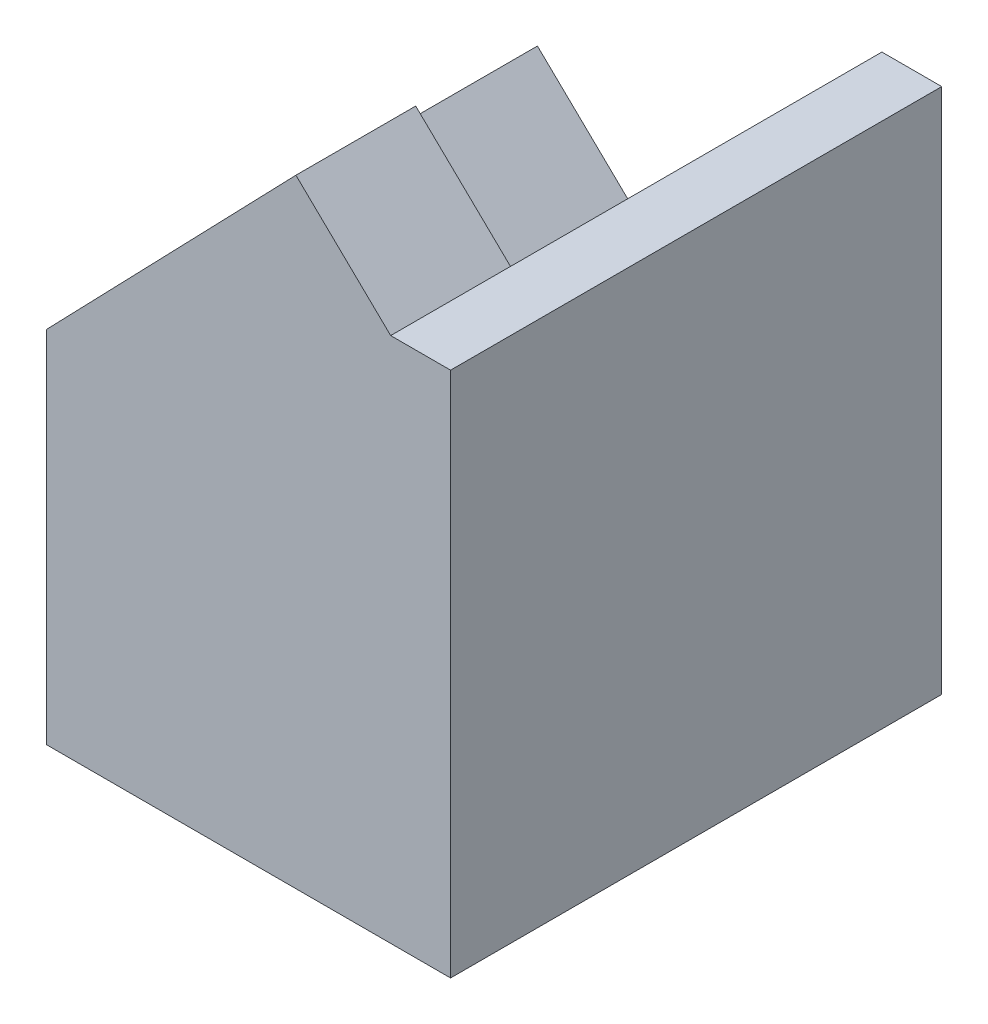
ISO-10303-21;
HEADER;
FILE_DESCRIPTION(('STEP AP214'),'2;1');
FILE_NAME('part.step','',(''),(''),'','','');
FILE_SCHEMA(('AUTOMOTIVE_DESIGN { 1 0 10303 214 1 1 1 1 }'));
ENDSEC;
DATA;
#1=APPLICATION_CONTEXT('core data for automotive mechanical design processes');
#2=APPLICATION_PROTOCOL_DEFINITION('international standard','automotive_design',2000,#1);
#3=PRODUCT_CONTEXT('',#1,'mechanical');
#4=PRODUCT('Part','Part','',(#3));
#5=PRODUCT_RELATED_PRODUCT_CATEGORY('part','',(#4));
#6=PRODUCT_DEFINITION_FORMATION('','',#4);
#7=PRODUCT_DEFINITION_CONTEXT('part definition',#1,'design');
#8=PRODUCT_DEFINITION('design','',#6,#7);
#9=PRODUCT_DEFINITION_SHAPE('','',#8);
#10=(LENGTH_UNIT() NAMED_UNIT(*) SI_UNIT(.MILLI.,.METRE.));
#11=(NAMED_UNIT(*) PLANE_ANGLE_UNIT() SI_UNIT($,.RADIAN.));
#12=(NAMED_UNIT(*) SI_UNIT($,.STERADIAN.) SOLID_ANGLE_UNIT());
#13=UNCERTAINTY_MEASURE_WITH_UNIT(LENGTH_MEASURE(1.E-05),#10,'distance_accuracy_value','');
#14=(GEOMETRIC_REPRESENTATION_CONTEXT(3) GLOBAL_UNCERTAINTY_ASSIGNED_CONTEXT((#13)) GLOBAL_UNIT_ASSIGNED_CONTEXT((#10,
#11,#12)) REPRESENTATION_CONTEXT('',''));
#15=CARTESIAN_POINT('',(0.,0.,0.));
#16=DIRECTION('',(0.,0.,1.));
#17=DIRECTION('',(1.,0.,0.));
#18=AXIS2_PLACEMENT_3D('',#15,#16,#17);
#19=CARTESIAN_POINT('',(0.,2.,8.2));
#20=DIRECTION('',(1.,0.,0.));
#21=DIRECTION('',(0.,1.,0.));
#22=AXIS2_PLACEMENT_3D('',#19,#20,#21);
#23=PLANE('',#22);
#24=DIRECTION('',(0.,-1.,0.));
#25=VECTOR('',#24,1.);
#26=CARTESIAN_POINT('',(0.,2.,0.));
#27=LINE('',#26,#25);
#28=CARTESIAN_POINT('',(0.,2.,0.));
#29=VERTEX_POINT('',#28);
#30=CARTESIAN_POINT('',(0.,-4.,0.));
#31=VERTEX_POINT('',#30);
#32=EDGE_CURVE('E114',#29,#31,#27,.T.);
#33=ORIENTED_EDGE('',*,*,#32,.T.);
#34=DIRECTION('',(0.,0.,-1.));
#35=VECTOR('',#34,1.);
#36=CARTESIAN_POINT('',(0.,-4.,8.2));
#37=LINE('',#36,#35);
#38=CARTESIAN_POINT('',(0.,-4.,8.2));
#39=VERTEX_POINT('',#38);
#40=EDGE_CURVE('E197',#39,#31,#37,.T.);
#41=ORIENTED_EDGE('',*,*,#40,.F.);
#42=DIRECTION('',(0.,-1.,0.));
#43=VECTOR('',#42,1.);
#44=CARTESIAN_POINT('',(0.,2.,8.2));
#45=LINE('',#44,#43);
#46=CARTESIAN_POINT('',(0.,2.,8.2));
#47=VERTEX_POINT('',#46);
#48=EDGE_CURVE('E121',#47,#39,#45,.T.);
#49=ORIENTED_EDGE('',*,*,#48,.F.);
#50=DIRECTION('',(0.,0.,-1.));
#51=VECTOR('',#50,1.);
#52=CARTESIAN_POINT('',(0.,2.,8.2));
#53=LINE('',#52,#51);
#54=CARTESIAN_POINT('',(0.,2.,6.45));
#55=VERTEX_POINT('',#54);
#56=EDGE_CURVE('E110',#47,#55,#53,.T.);
#57=ORIENTED_EDGE('',*,*,#56,.T.);
#58=DIRECTION('',(0.,0.,1.));
#59=VECTOR('',#58,1.);
#60=CARTESIAN_POINT('',(0.,2.,6.45));
#61=LINE('',#60,#59);
#62=EDGE_CURVE('E167',#29,#55,#61,.T.);
#63=ORIENTED_EDGE('',*,*,#62,.F.);
#64=EDGE_LOOP('',(#33,#41,#49,#57,#63));
#65=FACE_BOUND('',#64,.T.);
#66=ADVANCED_FACE('F36',(#65),#23,.F.);
#67=CARTESIAN_POINT('',(6.75,0.,8.2));
#68=DIRECTION('',(-1.,0.,0.));
#69=DIRECTION('',(0.,0.,1.));
#70=AXIS2_PLACEMENT_3D('',#67,#68,#69);
#71=PLANE('',#70);
#72=DIRECTION('',(0.,1.,0.));
#73=VECTOR('',#72,1.);
#74=CARTESIAN_POINT('',(6.75,0.,0.));
#75=LINE('',#74,#73);
#76=CARTESIAN_POINT('',(6.75,-4.,0.));
#77=VERTEX_POINT('',#76);
#78=CARTESIAN_POINT('',(6.75,4.78827109095939,0.));
#79=VERTEX_POINT('',#78);
#80=EDGE_CURVE('E71',#77,#79,#75,.T.);
#81=ORIENTED_EDGE('',*,*,#80,.T.);
#82=DIRECTION('',(0.,0.,-1.));
#83=VECTOR('',#82,1.);
#84=CARTESIAN_POINT('',(6.75,4.78827109095939,8.2));
#85=LINE('',#84,#83);
#86=CARTESIAN_POINT('',(6.75,4.78827109095939,8.2));
#87=VERTEX_POINT('',#86);
#88=EDGE_CURVE('E43',#87,#79,#85,.T.);
#89=ORIENTED_EDGE('',*,*,#88,.F.);
#90=DIRECTION('',(0.,1.,0.));
#91=VECTOR('',#90,1.);
#92=CARTESIAN_POINT('',(6.75,0.,8.2));
#93=LINE('',#92,#91);
#94=CARTESIAN_POINT('',(6.75,-4.,8.2));
#95=VERTEX_POINT('',#94);
#96=EDGE_CURVE('E97',#95,#87,#93,.T.);
#97=ORIENTED_EDGE('',*,*,#96,.F.);
#98=DIRECTION('',(0.,0.,1.));
#99=VECTOR('',#98,1.);
#100=CARTESIAN_POINT('',(6.75,-4.,8.2));
#101=LINE('',#100,#99);
#102=EDGE_CURVE('E198',#77,#95,#101,.T.);
#103=ORIENTED_EDGE('',*,*,#102,.F.);
#104=EDGE_LOOP('',(#81,#89,#97,#103));
#105=FACE_BOUND('',#104,.T.);
#106=ADVANCED_FACE('F248',(#105),#71,.F.);
#107=CARTESIAN_POINT('',(6.75,4.78827109095939,8.2));
#108=DIRECTION('',(0.,-1.,0.));
#109=DIRECTION('',(0.,0.,-1.));
#110=AXIS2_PLACEMENT_3D('',#107,#108,#109);
#111=PLANE('',#110);
#112=DIRECTION('',(0.,0.,1.));
#113=VECTOR('',#112,1.);
#114=CARTESIAN_POINT('',(5.75096199389527,4.78827109095939,8.2));
#115=LINE('',#114,#113);
#116=CARTESIAN_POINT('',(5.75096199389527,4.78827109095939,0.));
#117=VERTEX_POINT('',#116);
#118=CARTESIAN_POINT('',(5.75096199389527,4.78827109095939,6.2));
#119=VERTEX_POINT('',#118);
#120=EDGE_CURVE('E50',#117,#119,#115,.T.);
#121=ORIENTED_EDGE('',*,*,#120,.T.);
#122=DIRECTION('',(-1.,0.,0.));
#123=VECTOR('',#122,1.);
#124=CARTESIAN_POINT('',(6.75,4.78827109095939,6.2));
#125=LINE('',#124,#123);
#126=CARTESIAN_POINT('',(5.75,4.78827109095939,6.2));
#127=VERTEX_POINT('',#126);
#128=EDGE_CURVE('E103',#119,#127,#125,.T.);
#129=ORIENTED_EDGE('',*,*,#128,.T.);
#130=DIRECTION('',(0.,0.,-1.));
#131=VECTOR('',#130,1.);
#132=CARTESIAN_POINT('',(5.75,4.78827109095939,8.2));
#133=LINE('',#132,#131);
#134=CARTESIAN_POINT('',(5.75,4.78827109095939,8.2));
#135=VERTEX_POINT('',#134);
#136=EDGE_CURVE('E101',#135,#127,#133,.T.);
#137=ORIENTED_EDGE('',*,*,#136,.F.);
#138=DIRECTION('',(-1.,0.,0.));
#139=VECTOR('',#138,1.);
#140=CARTESIAN_POINT('',(6.75,4.78827109095939,8.2));
#141=LINE('',#140,#139);
#142=EDGE_CURVE('E89',#87,#135,#141,.T.);
#143=ORIENTED_EDGE('',*,*,#142,.F.);
#144=ORIENTED_EDGE('',*,*,#88,.T.);
#145=DIRECTION('',(-1.,0.,0.));
#146=VECTOR('',#145,1.);
#147=CARTESIAN_POINT('',(6.75,4.78827109095939,0.));
#148=LINE('',#147,#146);
#149=EDGE_CURVE('E118',#79,#117,#148,.T.);
#150=ORIENTED_EDGE('',*,*,#149,.T.);
#151=EDGE_LOOP('',(#121,#129,#137,#143,#144,#150));
#152=FACE_BOUND('',#151,.T.);
#153=ADVANCED_FACE('F102',(#152),#111,.F.);
#154=CARTESIAN_POINT('',(5.75,4.78827109095939,8.2));
#155=DIRECTION('',(-0.694658370458999,-0.71933980033865,0.));
#156=DIRECTION('',(0.71933980033865,-0.694658370458999,0.));
#157=AXIS2_PLACEMENT_3D('',#154,#155,#156);
#158=PLANE('',#157);
#159=ORIENTED_EDGE('',*,*,#136,.T.);
#160=DIRECTION('',(-0.71933980033865,0.694658370458999,0.));
#161=VECTOR('',#160,1.);
#162=CARTESIAN_POINT('',(5.75,4.78827109095939,6.2));
#163=LINE('',#162,#161);
#164=CARTESIAN_POINT('',(4.16795022275399,6.3160388020319,6.2));
#165=VERTEX_POINT('',#164);
#166=EDGE_CURVE('E82',#127,#165,#163,.T.);
#167=ORIENTED_EDGE('',*,*,#166,.T.);
#168=DIRECTION('',(0.,0.,-1.));
#169=VECTOR('',#168,1.);
#170=CARTESIAN_POINT('',(4.16795022275399,6.3160388020319,8.2));
#171=LINE('',#170,#169);
#172=CARTESIAN_POINT('',(4.16795022275399,6.3160388020319,8.2));
#173=VERTEX_POINT('',#172);
#174=EDGE_CURVE('E105',#173,#165,#171,.T.);
#175=ORIENTED_EDGE('',*,*,#174,.F.);
#176=DIRECTION('',(-0.71933980033865,0.694658370458999,0.));
#177=VECTOR('',#176,1.);
#178=CARTESIAN_POINT('',(5.75,4.78827109095939,8.2));
#179=LINE('',#178,#177);
#180=EDGE_CURVE('E93',#135,#173,#179,.T.);
#181=ORIENTED_EDGE('',*,*,#180,.F.);
#182=EDGE_LOOP('',(#159,#167,#175,#181));
#183=FACE_BOUND('',#182,.T.);
#184=ADVANCED_FACE('F107',(#183),#158,.F.);
#185=CARTESIAN_POINT('',(4.16795022275399,6.3160388020319,8.2));
#186=DIRECTION('',(0.71933980033865,-0.694658370458999,0.));
#187=DIRECTION('',(0.694658370458999,0.71933980033865,0.));
#188=AXIS2_PLACEMENT_3D('',#185,#186,#187);
#189=PLANE('',#188);
#190=ORIENTED_EDGE('',*,*,#174,.T.);
#191=DIRECTION('',(0.694658370458999,0.71933980033865,0.));
#192=VECTOR('',#191,1.);
#193=CARTESIAN_POINT('',(4.86260859321299,7.03537860237055,6.2));
#194=LINE('',#193,#192);
#195=CARTESIAN_POINT('',(1.389316740918,3.4386796006773,6.2));
#196=VERTEX_POINT('',#195);
#197=EDGE_CURVE('E153',#196,#165,#194,.T.);
#198=ORIENTED_EDGE('',*,*,#197,.F.);
#199=DIRECTION('',(0.,0.,-1.));
#200=VECTOR('',#199,1.);
#201=CARTESIAN_POINT('',(1.389316740918,3.4386796006773,6.2));
#202=LINE('',#201,#200);
#203=CARTESIAN_POINT('',(1.389316740918,3.4386796006773,6.45));
#204=VERTEX_POINT('',#203);
#205=EDGE_CURVE('E157',#204,#196,#202,.T.);
#206=ORIENTED_EDGE('',*,*,#205,.F.);
#207=CARTESIAN_POINT('',(0.694658370458999,2.71933980033865,6.45));
#208=DIRECTION('',(-0.71933980033865,0.694658370458999,0.));
#209=DIRECTION('',(0.694658370458999,0.71933980033865,0.));
#210=AXIS2_PLACEMENT_3D('',#207,#208,#209);
#211=CIRCLE('',#210,1.);
#212=EDGE_CURVE('E169',#55,#204,#211,.T.);
#213=ORIENTED_EDGE('',*,*,#212,.F.);
#214=ORIENTED_EDGE('',*,*,#56,.F.);
#215=DIRECTION('',(-0.694658370458999,-0.71933980033865,0.));
#216=VECTOR('',#215,1.);
#217=CARTESIAN_POINT('',(4.16795022275399,6.3160388020319,8.2));
#218=LINE('',#217,#216);
#219=EDGE_CURVE('E58',#173,#47,#218,.T.);
#220=ORIENTED_EDGE('',*,*,#219,.F.);
#221=EDGE_LOOP('',(#190,#198,#206,#213,#214,#220));
#222=FACE_BOUND('',#221,.T.);
#223=ADVANCED_FACE('F259',(#222),#189,.F.);
#224=CARTESIAN_POINT('',(0.,0.,8.2));
#225=DIRECTION('',(0.,0.,1.));
#226=DIRECTION('',(1.,0.,0.));
#227=AXIS2_PLACEMENT_3D('',#224,#225,#226);
#228=PLANE('',#227);
#229=ORIENTED_EDGE('',*,*,#48,.T.);
#230=DIRECTION('',(-1.,0.,0.));
#231=VECTOR('',#230,1.);
#232=CARTESIAN_POINT('',(0.,-4.,8.2));
#233=LINE('',#232,#231);
#234=EDGE_CURVE('E160',#95,#39,#233,.T.);
#235=ORIENTED_EDGE('',*,*,#234,.F.);
#236=ORIENTED_EDGE('',*,*,#96,.T.);
#237=ORIENTED_EDGE('',*,*,#142,.T.);
#238=ORIENTED_EDGE('',*,*,#180,.T.);
#239=ORIENTED_EDGE('',*,*,#219,.T.);
#240=EDGE_LOOP('',(#229,#235,#236,#237,#238,#239));
#241=FACE_BOUND('',#240,.T.);
#242=ADVANCED_FACE('F91',(#241),#228,.T.);
#243=CARTESIAN_POINT('',(0.,0.,0.));
#244=DIRECTION('',(0.,0.,1.));
#245=DIRECTION('',(1.,0.,0.));
#246=AXIS2_PLACEMENT_3D('',#243,#244,#245);
#247=PLANE('',#246);
#248=ORIENTED_EDGE('',*,*,#32,.F.);
#249=DIRECTION('',(-0.71933980033865,0.694658370458999,0.));
#250=VECTOR('',#249,1.);
#251=CARTESIAN_POINT('',(1.58254756074503,0.471751584990203,0.));
#252=LINE('',#251,#250);
#253=CARTESIAN_POINT('',(1.58254756074503,0.471751584990203,0.));
#254=VERTEX_POINT('',#253);
#255=EDGE_CURVE('E134',#254,#29,#252,.T.);
#256=ORIENTED_EDGE('',*,*,#255,.F.);
#257=DIRECTION('',(0.694658370458999,0.71933980033865,0.));
#258=VECTOR('',#257,1.);
#259=CARTESIAN_POINT('',(0.583156733725934,-0.563147911712295,0.));
#260=LINE('',#259,#258);
#261=EDGE_CURVE('E11',#254,#117,#260,.T.);
#262=ORIENTED_EDGE('',*,*,#261,.T.);
#263=ORIENTED_EDGE('',*,*,#149,.F.);
#264=ORIENTED_EDGE('',*,*,#80,.F.);
#265=DIRECTION('',(1.,0.,0.));
#266=VECTOR('',#265,1.);
#267=CARTESIAN_POINT('',(0.,-4.,0.));
#268=LINE('',#267,#266);
#269=EDGE_CURVE('E199',#31,#77,#268,.T.);
#270=ORIENTED_EDGE('',*,*,#269,.F.);
#271=EDGE_LOOP('',(#248,#256,#262,#263,#264,#270));
#272=FACE_BOUND('',#271,.T.);
#273=ADVANCED_FACE('F127',(#272),#247,.F.);
#274=CARTESIAN_POINT('',(6.44515615395802,5.50713018736075,6.2));
#275=DIRECTION('',(0.,0.,1.));
#276=DIRECTION('',(0.,-1.,0.));
#277=AXIS2_PLACEMENT_3D('',#274,#275,#276);
#278=PLANE('',#277);
#279=DIRECTION('',(0.694658370458999,0.71933980033865,0.));
#280=VECTOR('',#279,1.);
#281=CARTESIAN_POINT('',(6.44515615395802,5.50713018736075,6.2));
#282=LINE('',#281,#280);
#283=CARTESIAN_POINT('',(2.97186430166303,1.9104311856675,6.2));
#284=VERTEX_POINT('',#283);
#285=EDGE_CURVE('E165',#284,#119,#282,.T.);
#286=ORIENTED_EDGE('',*,*,#285,.F.);
#287=DIRECTION('',(-0.71933980033865,0.694658370458999,0.));
#288=VECTOR('',#287,1.);
#289=CARTESIAN_POINT('',(2.97186430166303,1.9104311856675,6.2));
#290=LINE('',#289,#288);
#291=EDGE_CURVE('E174',#284,#196,#290,.T.);
#292=ORIENTED_EDGE('',*,*,#291,.T.);
#293=ORIENTED_EDGE('',*,*,#197,.T.);
#294=ORIENTED_EDGE('',*,*,#166,.F.);
#295=ORIENTED_EDGE('',*,*,#128,.F.);
#296=EDGE_LOOP('',(#286,#292,#293,#294,#295));
#297=FACE_BOUND('',#296,.T.);
#298=ADVANCED_FACE('F265',(#297),#278,.F.);
#299=CARTESIAN_POINT('',(2.27720593120403,1.19109138532885,6.45));
#300=DIRECTION('',(0.71933980033865,-0.694658370458999,0.));
#301=DIRECTION('',(0.694658370458999,0.71933980033865,0.));
#302=AXIS2_PLACEMENT_3D('',#299,#300,#301);
#303=PLANE('',#302);
#304=ORIENTED_EDGE('',*,*,#261,.F.);
#305=DIRECTION('',(0.,0.,1.));
#306=VECTOR('',#305,1.);
#307=CARTESIAN_POINT('',(1.58254756074503,0.471751584990203,6.45));
#308=LINE('',#307,#306);
#309=CARTESIAN_POINT('',(1.58254756074503,0.471751584990203,6.45));
#310=VERTEX_POINT('',#309);
#311=EDGE_CURVE('E140',#254,#310,#308,.T.);
#312=ORIENTED_EDGE('',*,*,#311,.T.);
#313=CARTESIAN_POINT('',(2.27720593120403,1.19109138532885,6.45));
#314=DIRECTION('',(-0.71933980033865,0.694658370458999,0.));
#315=DIRECTION('',(0.694658370458999,0.71933980033865,0.));
#316=AXIS2_PLACEMENT_3D('',#313,#314,#315);
#317=CIRCLE('',#316,1.);
#318=CARTESIAN_POINT('',(2.97186430166303,1.9104311856675,6.45));
#319=VERTEX_POINT('',#318);
#320=EDGE_CURVE('E152',#310,#319,#317,.T.);
#321=ORIENTED_EDGE('',*,*,#320,.T.);
#322=DIRECTION('',(0.,0.,-1.));
#323=VECTOR('',#322,1.);
#324=CARTESIAN_POINT('',(2.97186430166303,1.9104311856675,6.2));
#325=LINE('',#324,#323);
#326=EDGE_CURVE('E155',#319,#284,#325,.T.);
#327=ORIENTED_EDGE('',*,*,#326,.T.);
#328=ORIENTED_EDGE('',*,*,#285,.T.);
#329=ORIENTED_EDGE('',*,*,#120,.F.);
#330=EDGE_LOOP('',(#304,#312,#321,#327,#328,#329));
#331=FACE_BOUND('',#330,.T.);
#332=ADVANCED_FACE('F137',(#331),#303,.F.);
#333=CARTESIAN_POINT('',(2.97186430166303,1.9104311856675,6.2));
#334=DIRECTION('',(0.694658370458999,0.71933980033865,0.));
#335=DIRECTION('',(-0.71933980033865,0.694658370458999,0.));
#336=AXIS2_PLACEMENT_3D('',#333,#334,#335);
#337=PLANE('',#336);
#338=ORIENTED_EDGE('',*,*,#205,.T.);
#339=ORIENTED_EDGE('',*,*,#291,.F.);
#340=ORIENTED_EDGE('',*,*,#326,.F.);
#341=DIRECTION('',(-0.71933980033865,0.694658370458999,0.));
#342=VECTOR('',#341,1.);
#343=CARTESIAN_POINT('',(2.97186430166303,1.9104311856675,6.45));
#344=LINE('',#343,#342);
#345=EDGE_CURVE('E177',#319,#204,#344,.T.);
#346=ORIENTED_EDGE('',*,*,#345,.T.);
#347=EDGE_LOOP('',(#338,#339,#340,#346));
#348=FACE_BOUND('',#347,.T.);
#349=ADVANCED_FACE('F273',(#348),#337,.F.);
#350=CARTESIAN_POINT('',(2.27720593120403,1.19109138532885,6.45));
#351=DIRECTION('',(-0.71933980033865,0.694658370458999,0.));
#352=DIRECTION('',(-0.694658370458999,-0.71933980033865,0.));
#353=AXIS2_PLACEMENT_3D('',#350,#351,#352);
#354=CYLINDRICAL_SURFACE('',#353,1.);
#355=ORIENTED_EDGE('',*,*,#212,.T.);
#356=ORIENTED_EDGE('',*,*,#345,.F.);
#357=ORIENTED_EDGE('',*,*,#320,.F.);
#358=DIRECTION('',(-0.71933980033865,0.694658370458999,0.));
#359=VECTOR('',#358,1.);
#360=CARTESIAN_POINT('',(1.58254756074503,0.471751584990203,6.45));
#361=LINE('',#360,#359);
#362=EDGE_CURVE('E150',#310,#55,#361,.T.);
#363=ORIENTED_EDGE('',*,*,#362,.T.);
#364=EDGE_LOOP('',(#355,#356,#357,#363));
#365=FACE_BOUND('',#364,.T.);
#366=ADVANCED_FACE('F270',(#365),#354,.F.);
#367=CARTESIAN_POINT('',(1.58254756074503,0.471751584990203,6.45));
#368=DIRECTION('',(-0.694658370458999,-0.71933980033865,0.));
#369=DIRECTION('',(0.71933980033865,-0.694658370458999,0.));
#370=AXIS2_PLACEMENT_3D('',#367,#368,#369);
#371=PLANE('',#370);
#372=ORIENTED_EDGE('',*,*,#62,.T.);
#373=ORIENTED_EDGE('',*,*,#362,.F.);
#374=ORIENTED_EDGE('',*,*,#311,.F.);
#375=ORIENTED_EDGE('',*,*,#255,.T.);
#376=EDGE_LOOP('',(#372,#373,#374,#375));
#377=FACE_BOUND('',#376,.T.);
#378=ADVANCED_FACE('F146',(#377),#371,.F.);
#379=CARTESIAN_POINT('',(0.,-4.,0.));
#380=DIRECTION('',(0.,-1.,0.));
#381=DIRECTION('',(0.,0.,-1.));
#382=AXIS2_PLACEMENT_3D('',#379,#380,#381);
#383=PLANE('',#382);
#384=CARTESIAN_POINT('',(3.75,-4.,7.1));
#385=DIRECTION('',(0.,-1.,0.));
#386=DIRECTION('',(0.,0.,-1.));
#387=AXIS2_PLACEMENT_3D('',#384,#385,#386);
#388=CIRCLE('',#387,0.749999999999989);
#389=CARTESIAN_POINT('',(3.75,-4.,6.35000000000001));
#390=VERTEX_POINT('',#389);
#391=EDGE_CURVE('E218',#390,#390,#388,.T.);
#392=ORIENTED_EDGE('',*,*,#391,.F.);
#393=EDGE_LOOP('',(#392));
#394=FACE_BOUND('',#393,.T.);
#395=CARTESIAN_POINT('',(3.75,-4.,1.1));
#396=DIRECTION('',(0.,-1.,0.));
#397=DIRECTION('',(0.,0.,-1.));
#398=AXIS2_PLACEMENT_3D('',#395,#396,#397);
#399=CIRCLE('',#398,0.749999999999989);
#400=CARTESIAN_POINT('',(3.75,-4.,0.350000000000011));
#401=VERTEX_POINT('',#400);
#402=EDGE_CURVE('E212',#401,#401,#399,.T.);
#403=ORIENTED_EDGE('',*,*,#402,.F.);
#404=EDGE_LOOP('',(#403));
#405=FACE_BOUND('',#404,.T.);
#406=CARTESIAN_POINT('',(3.75,-4.,4.1));
#407=DIRECTION('',(0.,-1.,0.));
#408=DIRECTION('',(0.,0.,-1.));
#409=AXIS2_PLACEMENT_3D('',#406,#407,#408);
#410=CIRCLE('',#409,0.79999999999999);
#411=CARTESIAN_POINT('',(3.75,-4.,3.30000000000001));
#412=VERTEX_POINT('',#411);
#413=EDGE_CURVE('E204',#412,#412,#410,.T.);
#414=ORIENTED_EDGE('',*,*,#413,.F.);
#415=EDGE_LOOP('',(#414));
#416=FACE_BOUND('',#415,.T.);
#417=ORIENTED_EDGE('',*,*,#40,.T.);
#418=ORIENTED_EDGE('',*,*,#269,.T.);
#419=ORIENTED_EDGE('',*,*,#102,.T.);
#420=ORIENTED_EDGE('',*,*,#234,.T.);
#421=EDGE_LOOP('',(#417,#418,#419,#420));
#422=FACE_BOUND('',#421,.T.);
#423=ADVANCED_FACE('F195',(#394,#405,#416,#422),#383,.T.);
#424=CARTESIAN_POINT('',(3.75,0.7,4.1));
#425=DIRECTION('',(0.,-1.,0.));
#426=DIRECTION('',(0.,0.,-1.));
#427=AXIS2_PLACEMENT_3D('',#424,#425,#426);
#428=CONICAL_SURFACE('',#427,0.799999999999999,1.02974425867665);
#429=CARTESIAN_POINT('',(3.75,1.18068849522205,4.1));
#430=VERTEX_POINT('',#429);
#431=VERTEX_LOOP('',#430);
#432=FACE_BOUND('',#431,.T.);
#433=CARTESIAN_POINT('',(3.75,0.7,4.1));
#434=DIRECTION('',(0.,-1.,0.));
#435=DIRECTION('',(0.,0.,-1.));
#436=AXIS2_PLACEMENT_3D('',#433,#434,#435);
#437=CIRCLE('',#436,0.799999999999999);
#438=CARTESIAN_POINT('',(3.75,0.7,3.3));
#439=VERTEX_POINT('',#438);
#440=EDGE_CURVE('E200',#439,#439,#437,.T.);
#441=ORIENTED_EDGE('',*,*,#440,.T.);
#442=EDGE_LOOP('',(#441));
#443=FACE_BOUND('',#442,.T.);
#444=ADVANCED_FACE('F226',(#432,#443),#428,.F.);
#445=CARTESIAN_POINT('',(3.75,-4.,4.1));
#446=DIRECTION('',(0.,-1.,0.));
#447=DIRECTION('',(0.,0.,-1.));
#448=AXIS2_PLACEMENT_3D('',#445,#446,#447);
#449=CYLINDRICAL_SURFACE('',#448,0.799999999999994);
#450=ORIENTED_EDGE('',*,*,#440,.F.);
#451=EDGE_LOOP('',(#450));
#452=FACE_BOUND('',#451,.T.);
#453=ORIENTED_EDGE('',*,*,#413,.T.);
#454=EDGE_LOOP('',(#453));
#455=FACE_BOUND('',#454,.T.);
#456=ADVANCED_FACE('F232',(#452,#455),#449,.F.);
#457=CARTESIAN_POINT('',(3.75,-1.,1.1));
#458=DIRECTION('',(0.,-1.,0.));
#459=DIRECTION('',(0.,0.,-1.));
#460=AXIS2_PLACEMENT_3D('',#457,#458,#459);
#461=CONICAL_SURFACE('',#460,0.749999999999999,1.02974425867665);
#462=CARTESIAN_POINT('',(3.75,-0.54935453572933,1.1));
#463=VERTEX_POINT('',#462);
#464=VERTEX_LOOP('',#463);
#465=FACE_BOUND('',#464,.T.);
#466=CARTESIAN_POINT('',(3.75,-1.,1.1));
#467=DIRECTION('',(0.,-1.,0.));
#468=DIRECTION('',(0.,0.,-1.));
#469=AXIS2_PLACEMENT_3D('',#466,#467,#468);
#470=CIRCLE('',#469,0.749999999999999);
#471=CARTESIAN_POINT('',(3.75,-1.,0.35));
#472=VERTEX_POINT('',#471);
#473=EDGE_CURVE('E209',#472,#472,#470,.T.);
#474=ORIENTED_EDGE('',*,*,#473,.T.);
#475=EDGE_LOOP('',(#474));
#476=FACE_BOUND('',#475,.T.);
#477=ADVANCED_FACE('F234',(#465,#476),#461,.F.);
#478=CARTESIAN_POINT('',(3.75,-4.,1.1));
#479=DIRECTION('',(0.,-1.,0.));
#480=DIRECTION('',(0.,0.,-1.));
#481=AXIS2_PLACEMENT_3D('',#478,#479,#480);
#482=CYLINDRICAL_SURFACE('',#481,0.749999999999994);
#483=ORIENTED_EDGE('',*,*,#473,.F.);
#484=EDGE_LOOP('',(#483));
#485=FACE_BOUND('',#484,.T.);
#486=ORIENTED_EDGE('',*,*,#402,.T.);
#487=EDGE_LOOP('',(#486));
#488=FACE_BOUND('',#487,.T.);
#489=ADVANCED_FACE('F241',(#485,#488),#482,.F.);
#490=CARTESIAN_POINT('',(3.75,-1.,7.1));
#491=DIRECTION('',(0.,-1.,0.));
#492=DIRECTION('',(0.,0.,-1.));
#493=AXIS2_PLACEMENT_3D('',#490,#491,#492);
#494=CONICAL_SURFACE('',#493,0.749999999999999,1.02974425867665);
#495=CARTESIAN_POINT('',(3.75,-0.54935453572933,7.1));
#496=VERTEX_POINT('',#495);
#497=VERTEX_LOOP('',#496);
#498=FACE_BOUND('',#497,.T.);
#499=CARTESIAN_POINT('',(3.75,-1.,7.1));
#500=DIRECTION('',(0.,-1.,0.));
#501=DIRECTION('',(0.,0.,-1.));
#502=AXIS2_PLACEMENT_3D('',#499,#500,#501);
#503=CIRCLE('',#502,0.749999999999999);
#504=CARTESIAN_POINT('',(3.75,-1.,6.35));
#505=VERTEX_POINT('',#504);
#506=EDGE_CURVE('E215',#505,#505,#503,.T.);
#507=ORIENTED_EDGE('',*,*,#506,.T.);
#508=EDGE_LOOP('',(#507));
#509=FACE_BOUND('',#508,.T.);
#510=ADVANCED_FACE('F332',(#498,#509),#494,.F.);
#511=CARTESIAN_POINT('',(3.75,-4.,7.1));
#512=DIRECTION('',(0.,-1.,0.));
#513=DIRECTION('',(0.,0.,-1.));
#514=AXIS2_PLACEMENT_3D('',#511,#512,#513);
#515=CYLINDRICAL_SURFACE('',#514,0.749999999999994);
#516=ORIENTED_EDGE('',*,*,#506,.F.);
#517=EDGE_LOOP('',(#516));
#518=FACE_BOUND('',#517,.T.);
#519=ORIENTED_EDGE('',*,*,#391,.T.);
#520=EDGE_LOOP('',(#519));
#521=FACE_BOUND('',#520,.T.);
#522=ADVANCED_FACE('F222',(#518,#521),#515,.F.);
#523=CLOSED_SHELL('',(#66,#106,#153,#184,#223,#242,#273,#298,#332,#349,#366,#378,#423,#444,#456,
#477,#489,#510,#522));
#524=MANIFOLD_SOLID_BREP('B2',#523);
#525=ADVANCED_BREP_SHAPE_REPRESENTATION('',(#18,#524),#14);
#526=SHAPE_DEFINITION_REPRESENTATION(#9,#525);
ENDSEC;
END-ISO-10303-21;
